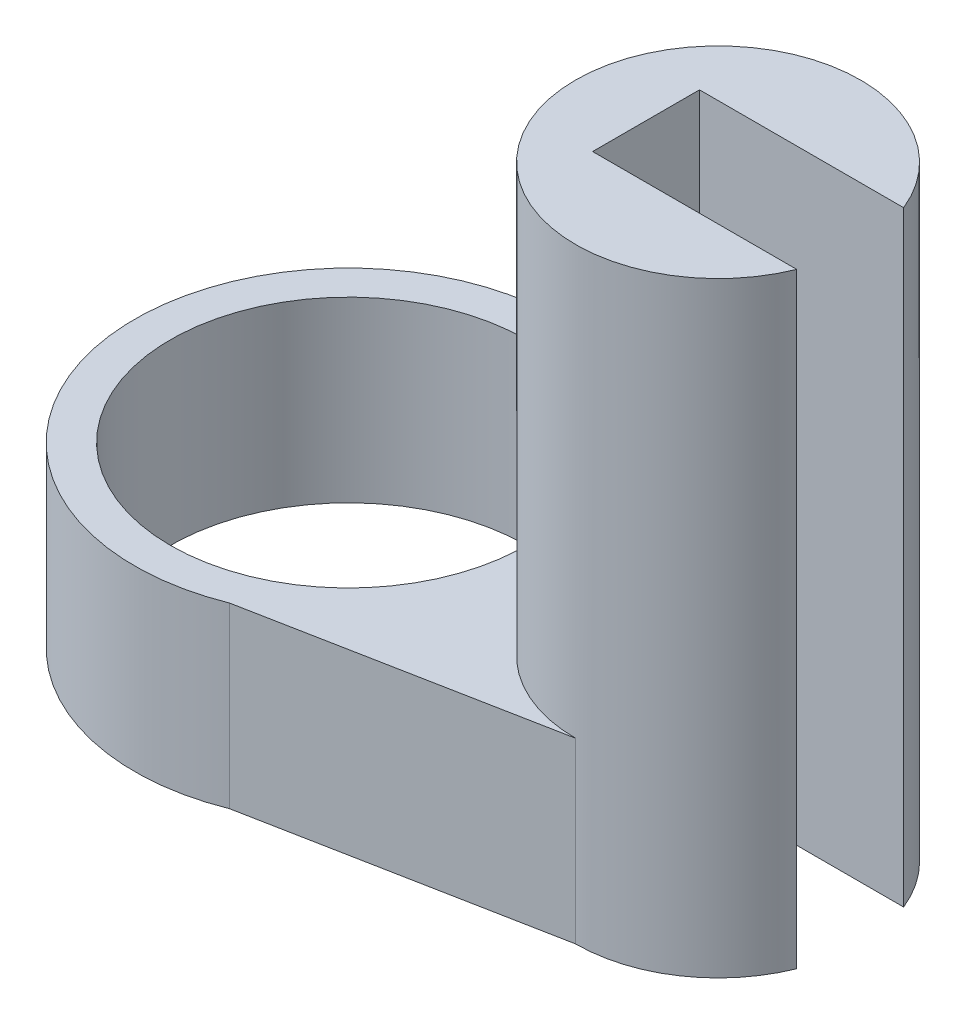
ISO-10303-21;
HEADER;
FILE_DESCRIPTION(('STEP AP214'),'2;1');
FILE_NAME('part.step','',(''),(''),'','','');
FILE_SCHEMA(('AUTOMOTIVE_DESIGN { 1 0 10303 214 1 1 1 1 }'));
ENDSEC;
DATA;
#1=APPLICATION_CONTEXT('core data for automotive mechanical design processes');
#2=APPLICATION_PROTOCOL_DEFINITION('international standard','automotive_design',2000,#1);
#3=PRODUCT_CONTEXT('',#1,'mechanical');
#4=PRODUCT('Part','Part','',(#3));
#5=PRODUCT_RELATED_PRODUCT_CATEGORY('part','',(#4));
#6=PRODUCT_DEFINITION_FORMATION('','',#4);
#7=PRODUCT_DEFINITION_CONTEXT('part definition',#1,'design');
#8=PRODUCT_DEFINITION('design','',#6,#7);
#9=PRODUCT_DEFINITION_SHAPE('','',#8);
#10=(LENGTH_UNIT() NAMED_UNIT(*) SI_UNIT(.MILLI.,.METRE.));
#11=(NAMED_UNIT(*) PLANE_ANGLE_UNIT() SI_UNIT($,.RADIAN.));
#12=(NAMED_UNIT(*) SI_UNIT($,.STERADIAN.) SOLID_ANGLE_UNIT());
#13=UNCERTAINTY_MEASURE_WITH_UNIT(LENGTH_MEASURE(1.E-05),#10,'distance_accuracy_value','');
#14=(GEOMETRIC_REPRESENTATION_CONTEXT(3) GLOBAL_UNCERTAINTY_ASSIGNED_CONTEXT((#13)) GLOBAL_UNIT_ASSIGNED_CONTEXT((#10,
#11,#12)) REPRESENTATION_CONTEXT('',''));
#15=CARTESIAN_POINT('',(0.,0.,0.));
#16=DIRECTION('',(0.,0.,1.));
#17=DIRECTION('',(1.,0.,0.));
#18=AXIS2_PLACEMENT_3D('',#15,#16,#17);
#19=CARTESIAN_POINT('',(0.,5.,0.));
#20=DIRECTION('',(0.,-1.,0.));
#21=DIRECTION('',(0.,0.,-1.));
#22=AXIS2_PLACEMENT_3D('',#19,#20,#21);
#23=CYLINDRICAL_SURFACE('',#22,6.);
#24=DIRECTION('',(0.,-1.,0.));
#25=VECTOR('',#24,1.);
#26=CARTESIAN_POINT('',(2.23075548219478,5.,-5.56989497016397));
#27=LINE('',#26,#25);
#28=CARTESIAN_POINT('',(2.23075548219478,0.,-5.56989497016397));
#29=VERTEX_POINT('',#28);
#30=CARTESIAN_POINT('',(2.23075548219478,5.,-5.56989497016397));
#31=VERTEX_POINT('',#30);
#32=EDGE_CURVE('E186',#29,#31,#27,.F.);
#33=ORIENTED_EDGE('',*,*,#32,.F.);
#34=CARTESIAN_POINT('',(0.,0.,0.));
#35=DIRECTION('',(0.,1.,0.));
#36=DIRECTION('',(0.,0.,1.));
#37=AXIS2_PLACEMENT_3D('',#34,#35,#36);
#38=CIRCLE('',#37,6.);
#39=CARTESIAN_POINT('',(2.23075548219478,0.,5.56989497016397));
#40=VERTEX_POINT('',#39);
#41=EDGE_CURVE('E193',#29,#40,#38,.T.);
#42=ORIENTED_EDGE('',*,*,#41,.T.);
#43=DIRECTION('',(0.,-1.,0.));
#44=VECTOR('',#43,1.);
#45=CARTESIAN_POINT('',(2.23075548219478,5.,5.56989497016397));
#46=LINE('',#45,#44);
#47=CARTESIAN_POINT('',(2.23075548219478,5.,5.56989497016397));
#48=VERTEX_POINT('',#47);
#49=EDGE_CURVE('E189',#48,#40,#46,.T.);
#50=ORIENTED_EDGE('',*,*,#49,.F.);
#51=CARTESIAN_POINT('',(0.,5.,0.));
#52=DIRECTION('',(0.,1.,0.));
#53=DIRECTION('',(0.,0.,1.));
#54=AXIS2_PLACEMENT_3D('',#51,#52,#53);
#55=CIRCLE('',#54,6.);
#56=EDGE_CURVE('E61',#31,#48,#55,.T.);
#57=ORIENTED_EDGE('',*,*,#56,.F.);
#58=EDGE_LOOP('',(#33,#42,#50,#57));
#59=FACE_BOUND('',#58,.T.);
#60=ADVANCED_FACE('F38',(#59),#23,.T.);
#61=CARTESIAN_POINT('',(0.,5.,0.));
#62=DIRECTION('',(0.,1.,0.));
#63=DIRECTION('',(0.,0.,1.));
#64=AXIS2_PLACEMENT_3D('',#61,#62,#63);
#65=PLANE('',#64);
#66=CARTESIAN_POINT('',(10.3730732144436,5.,0.));
#67=DIRECTION('',(0.,1.,0.));
#68=DIRECTION('',(0.,0.,1.));
#69=AXIS2_PLACEMENT_3D('',#66,#67,#68);
#70=CIRCLE('',#69,4.);
#71=CARTESIAN_POINT('',(10.3730732144436,5.,-4.));
#72=VERTEX_POINT('',#71);
#73=CARTESIAN_POINT('',(10.3730732144436,5.,4.));
#74=VERTEX_POINT('',#73);
#75=EDGE_CURVE('E46',#72,#74,#70,.T.);
#76=ORIENTED_EDGE('',*,*,#75,.F.);
#77=DIRECTION('',(-0.981915431277221,0.,-0.189320061852063));
#78=VECTOR('',#77,1.);
#79=CARTESIAN_POINT('',(0.,5.,-6.));
#80=LINE('',#79,#78);
#81=EDGE_CURVE('E168',#72,#31,#80,.T.);
#82=ORIENTED_EDGE('',*,*,#81,.T.);
#83=ORIENTED_EDGE('',*,*,#56,.T.);
#84=DIRECTION('',(0.981915431277221,0.,-0.189320061852063));
#85=VECTOR('',#84,1.);
#86=CARTESIAN_POINT('',(10.3730732144436,5.,4.));
#87=LINE('',#86,#85);
#88=EDGE_CURVE('E164',#48,#74,#87,.T.);
#89=ORIENTED_EDGE('',*,*,#88,.T.);
#90=EDGE_LOOP('',(#76,#82,#83,#89));
#91=FACE_BOUND('',#90,.T.);
#92=CARTESIAN_POINT('',(0.,5.,0.));
#93=DIRECTION('',(0.,1.,0.));
#94=DIRECTION('',(0.,0.,1.));
#95=AXIS2_PLACEMENT_3D('',#92,#93,#94);
#96=CIRCLE('',#95,5.);
#97=CARTESIAN_POINT('',(0.,5.,5.));
#98=VERTEX_POINT('',#97);
#99=EDGE_CURVE('E148',#98,#98,#96,.T.);
#100=ORIENTED_EDGE('',*,*,#99,.F.);
#101=EDGE_LOOP('',(#100));
#102=FACE_BOUND('',#101,.T.);
#103=ADVANCED_FACE('F206',(#91,#102),#65,.T.);
#104=CARTESIAN_POINT('',(0.,0.,0.));
#105=DIRECTION('',(0.,1.,0.));
#106=DIRECTION('',(0.,0.,1.));
#107=AXIS2_PLACEMENT_3D('',#104,#105,#106);
#108=PLANE('',#107);
#109=CARTESIAN_POINT('',(0.,0.,0.));
#110=DIRECTION('',(0.,1.,0.));
#111=DIRECTION('',(0.,0.,1.));
#112=AXIS2_PLACEMENT_3D('',#109,#110,#111);
#113=CIRCLE('',#112,5.);
#114=CARTESIAN_POINT('',(0.,0.,5.));
#115=VERTEX_POINT('',#114);
#116=EDGE_CURVE('E152',#115,#115,#113,.T.);
#117=ORIENTED_EDGE('',*,*,#116,.T.);
#118=EDGE_LOOP('',(#117));
#119=FACE_BOUND('',#118,.T.);
#120=CARTESIAN_POINT('',(10.3730732144436,0.,0.));
#121=DIRECTION('',(0.,1.,0.));
#122=DIRECTION('',(0.,0.,1.));
#123=AXIS2_PLACEMENT_3D('',#120,#121,#122);
#124=CIRCLE('',#123,4.);
#125=CARTESIAN_POINT('',(14.0811724579915,0.,-1.5));
#126=VERTEX_POINT('',#125);
#127=CARTESIAN_POINT('',(10.3730732144436,0.,-4.));
#128=VERTEX_POINT('',#127);
#129=EDGE_CURVE('E156',#126,#128,#124,.T.);
#130=ORIENTED_EDGE('',*,*,#129,.F.);
#131=DIRECTION('',(-1.,0.,0.));
#132=VECTOR('',#131,1.);
#133=CARTESIAN_POINT('',(18.9773961944592,0.,-1.5));
#134=LINE('',#133,#132);
#135=CARTESIAN_POINT('',(8.35194844624527,0.,-1.5));
#136=VERTEX_POINT('',#135);
#137=EDGE_CURVE('E112',#126,#136,#134,.T.);
#138=ORIENTED_EDGE('',*,*,#137,.T.);
#139=DIRECTION('',(0.,0.,1.));
#140=VECTOR('',#139,1.);
#141=CARTESIAN_POINT('',(8.35194844624527,0.,1.5));
#142=LINE('',#141,#140);
#143=CARTESIAN_POINT('',(8.35194844624527,0.,1.5));
#144=VERTEX_POINT('',#143);
#145=EDGE_CURVE('E106',#136,#144,#142,.T.);
#146=ORIENTED_EDGE('',*,*,#145,.T.);
#147=DIRECTION('',(1.,0.,0.));
#148=VECTOR('',#147,1.);
#149=CARTESIAN_POINT('',(18.9773961944592,0.,1.5));
#150=LINE('',#149,#148);
#151=CARTESIAN_POINT('',(14.0811724579915,0.,1.5));
#152=VERTEX_POINT('',#151);
#153=EDGE_CURVE('E115',#144,#152,#150,.T.);
#154=ORIENTED_EDGE('',*,*,#153,.T.);
#155=CARTESIAN_POINT('',(10.3730732144436,0.,4.));
#156=VERTEX_POINT('',#155);
#157=EDGE_CURVE('E160',#156,#152,#124,.T.);
#158=ORIENTED_EDGE('',*,*,#157,.F.);
#159=DIRECTION('',(0.981915431277221,0.,-0.189320061852063));
#160=VECTOR('',#159,1.);
#161=CARTESIAN_POINT('',(10.3730732144436,0.,4.));
#162=LINE('',#161,#160);
#163=EDGE_CURVE('E163',#40,#156,#162,.T.);
#164=ORIENTED_EDGE('',*,*,#163,.F.);
#165=ORIENTED_EDGE('',*,*,#41,.F.);
#166=DIRECTION('',(-0.981915431277221,0.,-0.189320061852063));
#167=VECTOR('',#166,1.);
#168=CARTESIAN_POINT('',(0.,0.,-6.));
#169=LINE('',#168,#167);
#170=EDGE_CURVE('E169',#128,#29,#169,.T.);
#171=ORIENTED_EDGE('',*,*,#170,.F.);
#172=EDGE_LOOP('',(#130,#138,#146,#154,#158,#164,#165,#171));
#173=FACE_BOUND('',#172,.T.);
#174=ADVANCED_FACE('F125',(#119,#173),#108,.F.);
#175=CARTESIAN_POINT('',(10.3730732144436,5.,4.));
#176=DIRECTION('',(-0.189320061852063,0.,-0.981915431277221));
#177=DIRECTION('',(-0.981915431277221,0.,0.189320061852063));
#178=AXIS2_PLACEMENT_3D('',#175,#176,#177);
#179=PLANE('',#178);
#180=ORIENTED_EDGE('',*,*,#88,.F.);
#181=ORIENTED_EDGE('',*,*,#49,.T.);
#182=ORIENTED_EDGE('',*,*,#163,.T.);
#183=DIRECTION('',(0.,-1.,0.));
#184=VECTOR('',#183,1.);
#185=CARTESIAN_POINT('',(10.3730732144436,5.,4.));
#186=LINE('',#185,#184);
#187=EDGE_CURVE('E182',#74,#156,#186,.T.);
#188=ORIENTED_EDGE('',*,*,#187,.F.);
#189=EDGE_LOOP('',(#180,#181,#182,#188));
#190=FACE_BOUND('',#189,.T.);
#191=ADVANCED_FACE('F200',(#190),#179,.F.);
#192=CARTESIAN_POINT('',(0.,5.,-6.));
#193=DIRECTION('',(-0.189320061852063,0.,0.981915431277221));
#194=DIRECTION('',(0.981915431277221,0.,0.189320061852063));
#195=AXIS2_PLACEMENT_3D('',#192,#193,#194);
#196=PLANE('',#195);
#197=ORIENTED_EDGE('',*,*,#170,.T.);
#198=ORIENTED_EDGE('',*,*,#32,.T.);
#199=ORIENTED_EDGE('',*,*,#81,.F.);
#200=DIRECTION('',(0.,-1.,0.));
#201=VECTOR('',#200,1.);
#202=CARTESIAN_POINT('',(10.3730732144436,5.,-4.));
#203=LINE('',#202,#201);
#204=EDGE_CURVE('E173',#72,#128,#203,.T.);
#205=ORIENTED_EDGE('',*,*,#204,.T.);
#206=EDGE_LOOP('',(#197,#198,#199,#205));
#207=FACE_BOUND('',#206,.T.);
#208=ADVANCED_FACE('F210',(#207),#196,.F.);
#209=CARTESIAN_POINT('',(10.3730732144436,5.,0.));
#210=DIRECTION('',(0.,-1.,0.));
#211=DIRECTION('',(0.,0.,-1.));
#212=AXIS2_PLACEMENT_3D('',#209,#210,#211);
#213=CYLINDRICAL_SURFACE('',#212,4.);
#214=CARTESIAN_POINT('',(10.3730732144436,17.,0.));
#215=DIRECTION('',(0.,1.,0.));
#216=DIRECTION('',(0.,0.,1.));
#217=AXIS2_PLACEMENT_3D('',#214,#215,#216);
#218=CIRCLE('',#217,4.);
#219=CARTESIAN_POINT('',(14.0811724579915,17.,-1.5));
#220=VERTEX_POINT('',#219);
#221=CARTESIAN_POINT('',(14.0811724579915,17.,1.5));
#222=VERTEX_POINT('',#221);
#223=EDGE_CURVE('E144',#220,#222,#218,.T.);
#224=ORIENTED_EDGE('',*,*,#223,.F.);
#225=DIRECTION('',(0.,-1.,0.));
#226=VECTOR('',#225,1.);
#227=CARTESIAN_POINT('',(14.0811724579915,5.,-1.5));
#228=LINE('',#227,#226);
#229=EDGE_CURVE('E140',#220,#126,#228,.T.);
#230=ORIENTED_EDGE('',*,*,#229,.T.);
#231=ORIENTED_EDGE('',*,*,#129,.T.);
#232=ORIENTED_EDGE('',*,*,#204,.F.);
#233=ORIENTED_EDGE('',*,*,#75,.T.);
#234=ORIENTED_EDGE('',*,*,#187,.T.);
#235=ORIENTED_EDGE('',*,*,#157,.T.);
#236=DIRECTION('',(0.,-1.,0.));
#237=VECTOR('',#236,1.);
#238=CARTESIAN_POINT('',(14.0811724579915,5.,1.5));
#239=LINE('',#238,#237);
#240=EDGE_CURVE('E118',#152,#222,#239,.F.);
#241=ORIENTED_EDGE('',*,*,#240,.T.);
#242=EDGE_LOOP('',(#224,#230,#231,#232,#233,#234,#235,#241));
#243=FACE_BOUND('',#242,.T.);
#244=ADVANCED_FACE('F203',(#243),#213,.T.);
#245=CARTESIAN_POINT('',(0.,0.,0.));
#246=DIRECTION('',(0.,1.,0.));
#247=DIRECTION('',(0.,0.,1.));
#248=AXIS2_PLACEMENT_3D('',#245,#246,#247);
#249=CYLINDRICAL_SURFACE('',#248,5.);
#250=ORIENTED_EDGE('',*,*,#116,.F.);
#251=EDGE_LOOP('',(#250));
#252=FACE_BOUND('',#251,.T.);
#253=ORIENTED_EDGE('',*,*,#99,.T.);
#254=EDGE_LOOP('',(#253));
#255=FACE_BOUND('',#254,.T.);
#256=ADVANCED_FACE('F218',(#252,#255),#249,.F.);
#257=CARTESIAN_POINT('',(10.3730732144436,17.,0.));
#258=DIRECTION('',(0.,1.,0.));
#259=DIRECTION('',(0.,0.,1.));
#260=AXIS2_PLACEMENT_3D('',#257,#258,#259);
#261=PLANE('',#260);
#262=DIRECTION('',(-1.,0.,0.));
#263=VECTOR('',#262,1.);
#264=CARTESIAN_POINT('',(10.3730732144436,17.,-1.5));
#265=LINE('',#264,#263);
#266=CARTESIAN_POINT('',(8.35194844624527,17.,-1.5));
#267=VERTEX_POINT('',#266);
#268=EDGE_CURVE('E11',#220,#267,#265,.T.);
#269=ORIENTED_EDGE('',*,*,#268,.F.);
#270=ORIENTED_EDGE('',*,*,#223,.T.);
#271=DIRECTION('',(1.,0.,0.));
#272=VECTOR('',#271,1.);
#273=CARTESIAN_POINT('',(18.9773961944592,17.,1.5));
#274=LINE('',#273,#272);
#275=CARTESIAN_POINT('',(8.35194844624527,17.,1.5));
#276=VERTEX_POINT('',#275);
#277=EDGE_CURVE('E127',#276,#222,#274,.T.);
#278=ORIENTED_EDGE('',*,*,#277,.F.);
#279=DIRECTION('',(0.,0.,1.));
#280=VECTOR('',#279,1.);
#281=CARTESIAN_POINT('',(8.35194844624527,17.,1.5));
#282=LINE('',#281,#280);
#283=EDGE_CURVE('E53',#267,#276,#282,.T.);
#284=ORIENTED_EDGE('',*,*,#283,.F.);
#285=EDGE_LOOP('',(#269,#270,#278,#284));
#286=FACE_BOUND('',#285,.T.);
#287=ADVANCED_FACE('F216',(#286),#261,.T.);
#288=CARTESIAN_POINT('',(18.9773961944592,0.,-1.5));
#289=DIRECTION('',(0.,0.,-1.));
#290=DIRECTION('',(-1.,0.,0.));
#291=AXIS2_PLACEMENT_3D('',#288,#289,#290);
#292=PLANE('',#291);
#293=ORIENTED_EDGE('',*,*,#268,.T.);
#294=DIRECTION('',(0.,1.,0.));
#295=VECTOR('',#294,1.);
#296=CARTESIAN_POINT('',(8.35194844624527,0.,-1.5));
#297=LINE('',#296,#295);
#298=EDGE_CURVE('E111',#136,#267,#297,.T.);
#299=ORIENTED_EDGE('',*,*,#298,.F.);
#300=ORIENTED_EDGE('',*,*,#137,.F.);
#301=ORIENTED_EDGE('',*,*,#229,.F.);
#302=EDGE_LOOP('',(#293,#299,#300,#301));
#303=FACE_BOUND('',#302,.T.);
#304=ADVANCED_FACE('F214',(#303),#292,.F.);
#305=CARTESIAN_POINT('',(18.9773961944592,0.,1.5));
#306=DIRECTION('',(0.,0.,1.));
#307=DIRECTION('',(1.,0.,0.));
#308=AXIS2_PLACEMENT_3D('',#305,#306,#307);
#309=PLANE('',#308);
#310=ORIENTED_EDGE('',*,*,#153,.F.);
#311=DIRECTION('',(0.,1.,0.));
#312=VECTOR('',#311,1.);
#313=CARTESIAN_POINT('',(8.35194844624527,0.,1.5));
#314=LINE('',#313,#312);
#315=EDGE_CURVE('E102',#144,#276,#314,.T.);
#316=ORIENTED_EDGE('',*,*,#315,.T.);
#317=ORIENTED_EDGE('',*,*,#277,.T.);
#318=ORIENTED_EDGE('',*,*,#240,.F.);
#319=EDGE_LOOP('',(#310,#316,#317,#318));
#320=FACE_BOUND('',#319,.T.);
#321=ADVANCED_FACE('F116',(#320),#309,.F.);
#322=CARTESIAN_POINT('',(8.35194844624527,0.,1.5));
#323=DIRECTION('',(-1.,0.,0.));
#324=DIRECTION('',(0.,0.,1.));
#325=AXIS2_PLACEMENT_3D('',#322,#323,#324);
#326=PLANE('',#325);
#327=ORIENTED_EDGE('',*,*,#283,.T.);
#328=ORIENTED_EDGE('',*,*,#315,.F.);
#329=ORIENTED_EDGE('',*,*,#145,.F.);
#330=ORIENTED_EDGE('',*,*,#298,.T.);
#331=EDGE_LOOP('',(#327,#328,#329,#330));
#332=FACE_BOUND('',#331,.T.);
#333=ADVANCED_FACE('F104',(#332),#326,.F.);
#334=CLOSED_SHELL('',(#60,#103,#174,#191,#208,#244,#256,#287,#304,#321,#333));
#335=MANIFOLD_SOLID_BREP('B2',#334);
#336=ADVANCED_BREP_SHAPE_REPRESENTATION('',(#18,#335),#14);
#337=SHAPE_DEFINITION_REPRESENTATION(#9,#336);
ENDSEC;
END-ISO-10303-21;
